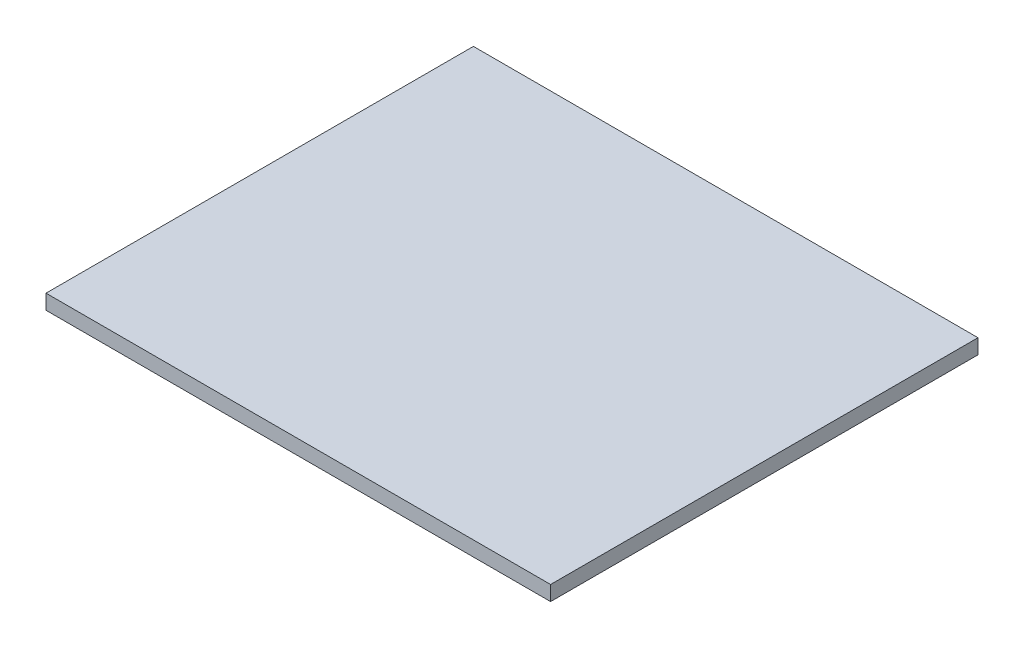
ISO-10303-21;
HEADER;
FILE_DESCRIPTION(('STEP AP214'),'2;1');
FILE_NAME('part.step','',(''),(''),'','','');
FILE_SCHEMA(('AUTOMOTIVE_DESIGN { 1 0 10303 214 1 1 1 1 }'));
ENDSEC;
DATA;
#1=APPLICATION_CONTEXT('core data for automotive mechanical design processes');
#2=APPLICATION_PROTOCOL_DEFINITION('international standard','automotive_design',2000,#1);
#3=PRODUCT_CONTEXT('',#1,'mechanical');
#4=PRODUCT('Part','Part','',(#3));
#5=PRODUCT_RELATED_PRODUCT_CATEGORY('part','',(#4));
#6=PRODUCT_DEFINITION_FORMATION('','',#4);
#7=PRODUCT_DEFINITION_CONTEXT('part definition',#1,'design');
#8=PRODUCT_DEFINITION('design','',#6,#7);
#9=PRODUCT_DEFINITION_SHAPE('','',#8);
#10=(LENGTH_UNIT() NAMED_UNIT(*) SI_UNIT(.MILLI.,.METRE.));
#11=(NAMED_UNIT(*) PLANE_ANGLE_UNIT() SI_UNIT($,.RADIAN.));
#12=(NAMED_UNIT(*) SI_UNIT($,.STERADIAN.) SOLID_ANGLE_UNIT());
#13=UNCERTAINTY_MEASURE_WITH_UNIT(LENGTH_MEASURE(1.E-05),#10,'distance_accuracy_value','');
#14=(GEOMETRIC_REPRESENTATION_CONTEXT(3) GLOBAL_UNCERTAINTY_ASSIGNED_CONTEXT((#13)) GLOBAL_UNIT_ASSIGNED_CONTEXT((#10,
#11,#12)) REPRESENTATION_CONTEXT('',''));
#15=CARTESIAN_POINT('',(0.,0.,0.));
#16=DIRECTION('',(0.,0.,1.));
#17=DIRECTION('',(1.,0.,0.));
#18=AXIS2_PLACEMENT_3D('',#15,#16,#17);
#19=CARTESIAN_POINT('',(107.95,6.35,-91.44));
#20=DIRECTION('',(-1.,0.,0.));
#21=DIRECTION('',(0.,0.,1.));
#22=AXIS2_PLACEMENT_3D('',#19,#20,#21);
#23=PLANE('',#22);
#24=DIRECTION('',(0.,0.,-1.));
#25=VECTOR('',#24,1.);
#26=CARTESIAN_POINT('',(107.95,0.,-91.44));
#27=LINE('',#26,#25);
#28=CARTESIAN_POINT('',(107.95,0.,91.44));
#29=VERTEX_POINT('',#28);
#30=CARTESIAN_POINT('',(107.95,0.,-91.44));
#31=VERTEX_POINT('',#30);
#32=EDGE_CURVE('E96',#29,#31,#27,.T.);
#33=ORIENTED_EDGE('',*,*,#32,.T.);
#34=DIRECTION('',(0.,-1.,0.));
#35=VECTOR('',#34,1.);
#36=CARTESIAN_POINT('',(107.95,6.35,-91.44));
#37=LINE('',#36,#35);
#38=CARTESIAN_POINT('',(107.95,6.35,-91.44));
#39=VERTEX_POINT('',#38);
#40=EDGE_CURVE('E11',#39,#31,#37,.T.);
#41=ORIENTED_EDGE('',*,*,#40,.F.);
#42=DIRECTION('',(0.,0.,-1.));
#43=VECTOR('',#42,1.);
#44=CARTESIAN_POINT('',(107.95,6.35,-91.44));
#45=LINE('',#44,#43);
#46=CARTESIAN_POINT('',(107.95,6.35,91.44));
#47=VERTEX_POINT('',#46);
#48=EDGE_CURVE('E84',#47,#39,#45,.T.);
#49=ORIENTED_EDGE('',*,*,#48,.F.);
#50=DIRECTION('',(0.,-1.,0.));
#51=VECTOR('',#50,1.);
#52=CARTESIAN_POINT('',(107.95,6.35,91.44));
#53=LINE('',#52,#51);
#54=EDGE_CURVE('E92',#47,#29,#53,.T.);
#55=ORIENTED_EDGE('',*,*,#54,.T.);
#56=EDGE_LOOP('',(#33,#41,#49,#55));
#57=FACE_BOUND('',#56,.T.);
#58=ADVANCED_FACE('F33',(#57),#23,.F.);
#59=CARTESIAN_POINT('',(-107.95,6.35,-91.44));
#60=DIRECTION('',(0.,0.,1.));
#61=DIRECTION('',(1.,0.,0.));
#62=AXIS2_PLACEMENT_3D('',#59,#60,#61);
#63=PLANE('',#62);
#64=DIRECTION('',(-1.,0.,0.));
#65=VECTOR('',#64,1.);
#66=CARTESIAN_POINT('',(-107.95,0.,-91.44));
#67=LINE('',#66,#65);
#68=CARTESIAN_POINT('',(-107.95,0.,-91.44));
#69=VERTEX_POINT('',#68);
#70=EDGE_CURVE('E88',#31,#69,#67,.T.);
#71=ORIENTED_EDGE('',*,*,#70,.T.);
#72=DIRECTION('',(0.,-1.,0.));
#73=VECTOR('',#72,1.);
#74=CARTESIAN_POINT('',(-107.95,6.35,-91.44));
#75=LINE('',#74,#73);
#76=CARTESIAN_POINT('',(-107.95,6.35,-91.44));
#77=VERTEX_POINT('',#76);
#78=EDGE_CURVE('E41',#77,#69,#75,.T.);
#79=ORIENTED_EDGE('',*,*,#78,.F.);
#80=DIRECTION('',(-1.,0.,0.));
#81=VECTOR('',#80,1.);
#82=CARTESIAN_POINT('',(-107.95,6.35,-91.44));
#83=LINE('',#82,#81);
#84=EDGE_CURVE('E79',#39,#77,#83,.T.);
#85=ORIENTED_EDGE('',*,*,#84,.F.);
#86=ORIENTED_EDGE('',*,*,#40,.T.);
#87=EDGE_LOOP('',(#71,#79,#85,#86));
#88=FACE_BOUND('',#87,.T.);
#89=ADVANCED_FACE('F87',(#88),#63,.F.);
#90=CARTESIAN_POINT('',(-107.95,6.35,-91.44));
#91=DIRECTION('',(1.,0.,0.));
#92=DIRECTION('',(0.,0.,-1.));
#93=AXIS2_PLACEMENT_3D('',#90,#91,#92);
#94=PLANE('',#93);
#95=DIRECTION('',(0.,0.,1.));
#96=VECTOR('',#95,1.);
#97=CARTESIAN_POINT('',(-107.95,0.,-91.44));
#98=LINE('',#97,#96);
#99=CARTESIAN_POINT('',(-107.95,0.,91.44));
#100=VERTEX_POINT('',#99);
#101=EDGE_CURVE('E66',#69,#100,#98,.T.);
#102=ORIENTED_EDGE('',*,*,#101,.T.);
#103=DIRECTION('',(0.,-1.,0.));
#104=VECTOR('',#103,1.);
#105=CARTESIAN_POINT('',(-107.95,6.35,91.44));
#106=LINE('',#105,#104);
#107=CARTESIAN_POINT('',(-107.95,6.35,91.44));
#108=VERTEX_POINT('',#107);
#109=EDGE_CURVE('E89',#108,#100,#106,.T.);
#110=ORIENTED_EDGE('',*,*,#109,.F.);
#111=DIRECTION('',(0.,0.,1.));
#112=VECTOR('',#111,1.);
#113=CARTESIAN_POINT('',(-107.95,6.35,-91.44));
#114=LINE('',#113,#112);
#115=EDGE_CURVE('E82',#77,#108,#114,.T.);
#116=ORIENTED_EDGE('',*,*,#115,.F.);
#117=ORIENTED_EDGE('',*,*,#78,.T.);
#118=EDGE_LOOP('',(#102,#110,#116,#117));
#119=FACE_BOUND('',#118,.T.);
#120=ADVANCED_FACE('F90',(#119),#94,.F.);
#121=CARTESIAN_POINT('',(-107.95,6.35,91.44));
#122=DIRECTION('',(0.,0.,-1.));
#123=DIRECTION('',(-1.,0.,0.));
#124=AXIS2_PLACEMENT_3D('',#121,#122,#123);
#125=PLANE('',#124);
#126=DIRECTION('',(1.,0.,0.));
#127=VECTOR('',#126,1.);
#128=CARTESIAN_POINT('',(-107.95,0.,91.44));
#129=LINE('',#128,#127);
#130=EDGE_CURVE('E72',#100,#29,#129,.T.);
#131=ORIENTED_EDGE('',*,*,#130,.T.);
#132=ORIENTED_EDGE('',*,*,#54,.F.);
#133=DIRECTION('',(1.,0.,0.));
#134=VECTOR('',#133,1.);
#135=CARTESIAN_POINT('',(-107.95,6.35,91.44));
#136=LINE('',#135,#134);
#137=EDGE_CURVE('E49',#108,#47,#136,.T.);
#138=ORIENTED_EDGE('',*,*,#137,.F.);
#139=ORIENTED_EDGE('',*,*,#109,.T.);
#140=EDGE_LOOP('',(#131,#132,#138,#139));
#141=FACE_BOUND('',#140,.T.);
#142=ADVANCED_FACE('F103',(#141),#125,.F.);
#143=CARTESIAN_POINT('',(0.,6.35,0.));
#144=DIRECTION('',(0.,1.,0.));
#145=DIRECTION('',(0.,0.,1.));
#146=AXIS2_PLACEMENT_3D('',#143,#144,#145);
#147=PLANE('',#146);
#148=ORIENTED_EDGE('',*,*,#48,.T.);
#149=ORIENTED_EDGE('',*,*,#84,.T.);
#150=ORIENTED_EDGE('',*,*,#115,.T.);
#151=ORIENTED_EDGE('',*,*,#137,.T.);
#152=EDGE_LOOP('',(#148,#149,#150,#151));
#153=FACE_BOUND('',#152,.T.);
#154=ADVANCED_FACE('F80',(#153),#147,.T.);
#155=CARTESIAN_POINT('',(0.,0.,0.));
#156=DIRECTION('',(0.,1.,0.));
#157=DIRECTION('',(0.,0.,1.));
#158=AXIS2_PLACEMENT_3D('',#155,#156,#157);
#159=PLANE('',#158);
#160=ORIENTED_EDGE('',*,*,#32,.F.);
#161=ORIENTED_EDGE('',*,*,#130,.F.);
#162=ORIENTED_EDGE('',*,*,#101,.F.);
#163=ORIENTED_EDGE('',*,*,#70,.F.);
#164=EDGE_LOOP('',(#160,#161,#162,#163));
#165=FACE_BOUND('',#164,.T.);
#166=ADVANCED_FACE('F106',(#165),#159,.F.);
#167=CLOSED_SHELL('',(#58,#89,#120,#142,#154,#166));
#168=MANIFOLD_SOLID_BREP('B2',#167);
#169=ADVANCED_BREP_SHAPE_REPRESENTATION('',(#18,#168),#14);
#170=SHAPE_DEFINITION_REPRESENTATION(#9,#169);
ENDSEC;
END-ISO-10303-21;
